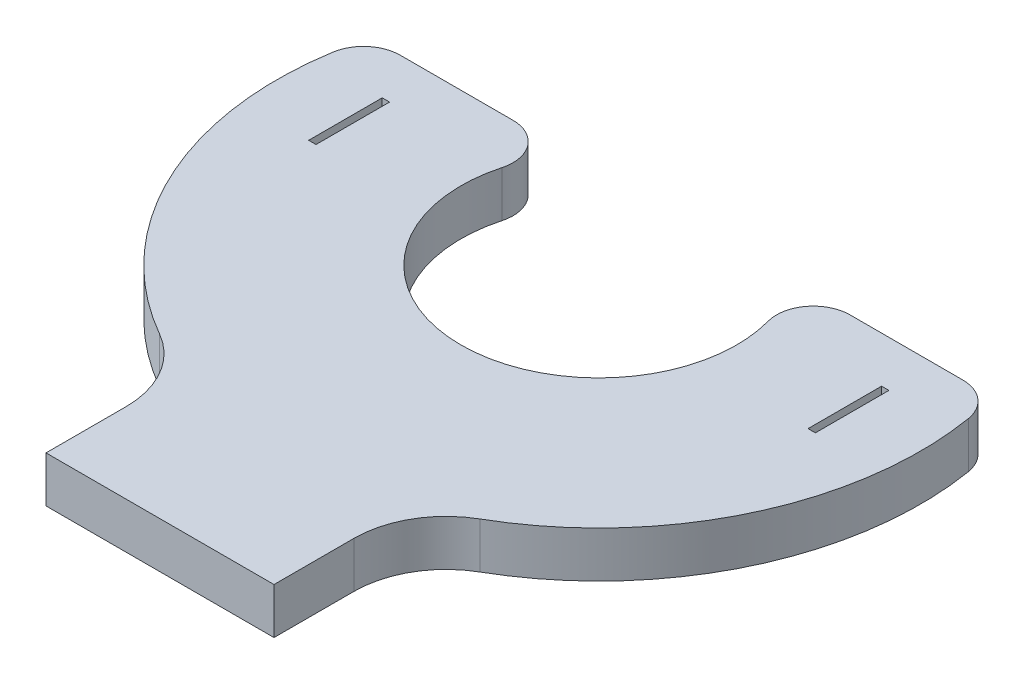
ISO-10303-21;
HEADER;
FILE_DESCRIPTION(('STEP AP214'),'2;1');
FILE_NAME('part.step','',(''),(''),'','','');
FILE_SCHEMA(('AUTOMOTIVE_DESIGN { 1 0 10303 214 1 1 1 1 }'));
ENDSEC;
DATA;
#1=APPLICATION_CONTEXT('core data for automotive mechanical design processes');
#2=APPLICATION_PROTOCOL_DEFINITION('international standard','automotive_design',2000,#1);
#3=PRODUCT_CONTEXT('',#1,'mechanical');
#4=PRODUCT('Part','Part','',(#3));
#5=PRODUCT_RELATED_PRODUCT_CATEGORY('part','',(#4));
#6=PRODUCT_DEFINITION_FORMATION('','',#4);
#7=PRODUCT_DEFINITION_CONTEXT('part definition',#1,'design');
#8=PRODUCT_DEFINITION('design','',#6,#7);
#9=PRODUCT_DEFINITION_SHAPE('','',#8);
#10=(LENGTH_UNIT() NAMED_UNIT(*) SI_UNIT(.MILLI.,.METRE.));
#11=(NAMED_UNIT(*) PLANE_ANGLE_UNIT() SI_UNIT($,.RADIAN.));
#12=(NAMED_UNIT(*) SI_UNIT($,.STERADIAN.) SOLID_ANGLE_UNIT());
#13=UNCERTAINTY_MEASURE_WITH_UNIT(LENGTH_MEASURE(1.E-05),#10,'distance_accuracy_value','');
#14=(GEOMETRIC_REPRESENTATION_CONTEXT(3) GLOBAL_UNCERTAINTY_ASSIGNED_CONTEXT((#13)) GLOBAL_UNIT_ASSIGNED_CONTEXT((#10,
#11,#12)) REPRESENTATION_CONTEXT('',''));
#15=CARTESIAN_POINT('',(0.,0.,0.));
#16=DIRECTION('',(0.,0.,1.));
#17=DIRECTION('',(1.,0.,0.));
#18=AXIS2_PLACEMENT_3D('',#15,#16,#17);
#19=CARTESIAN_POINT('',(0.,3.175,0.));
#20=DIRECTION('',(0.,1.,0.));
#21=DIRECTION('',(0.,0.,1.));
#22=AXIS2_PLACEMENT_3D('',#19,#20,#21);
#23=PLANE('',#22);
#24=DIRECTION('',(-1.,0.,0.));
#25=VECTOR('',#24,1.);
#26=CARTESIAN_POINT('',(-21.4776488471155,3.175,-5.71499999999996));
#27=LINE('',#26,#25);
#28=CARTESIAN_POINT('',(-11.6397422651878,3.175,-5.71499999999996));
#29=VERTEX_POINT('',#28);
#30=CARTESIAN_POINT('',(-19.4272643467885,3.175,-5.71499999999996));
#31=VERTEX_POINT('',#30);
#32=EDGE_CURVE('E273',#29,#31,#27,.T.);
#33=ORIENTED_EDGE('',*,*,#32,.T.);
#34=CARTESIAN_POINT('',(-19.4272643467885,3.175,-3.17499999999996));
#35=DIRECTION('',(0.,1.,0.));
#36=DIRECTION('',(0.,0.,1.));
#37=AXIS2_PLACEMENT_3D('',#34,#35,#36);
#38=CIRCLE('',#37,2.54);
#39=CARTESIAN_POINT('',(-21.9340081334709,3.175,-3.5846774193548));
#40=VERTEX_POINT('',#39);
#41=EDGE_CURVE('E323',#31,#40,#38,.T.);
#42=ORIENTED_EDGE('',*,*,#41,.T.);
#43=CARTESIAN_POINT('',(0.,3.175,0.));
#44=DIRECTION('',(0.,1.,0.));
#45=DIRECTION('',(0.,0.,1.));
#46=AXIS2_PLACEMENT_3D('',#43,#44,#45);
#47=CIRCLE('',#46,22.225);
#48=CARTESIAN_POINT('',(-11.0631111111111,3.175,19.2758449242364));
#49=VERTEX_POINT('',#48);
#50=EDGE_CURVE('E255',#40,#49,#47,.T.);
#51=ORIENTED_EDGE('',*,*,#50,.T.);
#52=CARTESIAN_POINT('',(-14.224,3.175,24.7832291883039));
#53=DIRECTION('',(0.,1.,0.));
#54=DIRECTION('',(0.,0.,1.));
#55=AXIS2_PLACEMENT_3D('',#52,#53,#54);
#56=CIRCLE('',#55,6.35);
#57=CARTESIAN_POINT('',(-7.874,3.175,24.7832291883039));
#58=VERTEX_POINT('',#57);
#59=EDGE_CURVE('E11',#49,#58,#56,.F.);
#60=ORIENTED_EDGE('',*,*,#59,.T.);
#61=DIRECTION('',(0.,0.,1.));
#62=VECTOR('',#61,1.);
#63=CARTESIAN_POINT('',(-7.874,3.175,20.7834248621347));
#64=LINE('',#63,#62);
#65=CARTESIAN_POINT('',(-7.874,3.175,30.3084248621347));
#66=VERTEX_POINT('',#65);
#67=EDGE_CURVE('E257',#58,#66,#64,.T.);
#68=ORIENTED_EDGE('',*,*,#67,.T.);
#69=DIRECTION('',(1.,0.,0.));
#70=VECTOR('',#69,1.);
#71=CARTESIAN_POINT('',(-7.874,3.175,30.3084248621347));
#72=LINE('',#71,#70);
#73=CARTESIAN_POINT('',(7.874,3.175,30.3084248621347));
#74=VERTEX_POINT('',#73);
#75=EDGE_CURVE('E260',#66,#74,#72,.T.);
#76=ORIENTED_EDGE('',*,*,#75,.T.);
#77=DIRECTION('',(0.,0.,-1.));
#78=VECTOR('',#77,1.);
#79=CARTESIAN_POINT('',(7.874,3.175,20.7834248621347));
#80=LINE('',#79,#78);
#81=CARTESIAN_POINT('',(7.874,3.175,24.7832291883039));
#82=VERTEX_POINT('',#81);
#83=EDGE_CURVE('E262',#74,#82,#80,.T.);
#84=ORIENTED_EDGE('',*,*,#83,.T.);
#85=CARTESIAN_POINT('',(14.224,3.175,24.7832291883039));
#86=DIRECTION('',(0.,1.,0.));
#87=DIRECTION('',(0.,0.,1.));
#88=AXIS2_PLACEMENT_3D('',#85,#86,#87);
#89=CIRCLE('',#88,6.35);
#90=CARTESIAN_POINT('',(11.0631111111111,3.175,19.2758449242364));
#91=VERTEX_POINT('',#90);
#92=EDGE_CURVE('E349',#82,#91,#89,.F.);
#93=ORIENTED_EDGE('',*,*,#92,.T.);
#94=CARTESIAN_POINT('',(0.,3.175,0.));
#95=DIRECTION('',(0.,1.,0.));
#96=DIRECTION('',(0.,0.,1.));
#97=AXIS2_PLACEMENT_3D('',#94,#95,#96);
#98=CIRCLE('',#97,22.225);
#99=CARTESIAN_POINT('',(21.9340081334709,3.175,-3.5846774193548));
#100=VERTEX_POINT('',#99);
#101=EDGE_CURVE('E265',#91,#100,#98,.T.);
#102=ORIENTED_EDGE('',*,*,#101,.T.);
#103=CARTESIAN_POINT('',(19.4272643467885,3.175,-3.17499999999996));
#104=DIRECTION('',(0.,1.,0.));
#105=DIRECTION('',(0.,0.,1.));
#106=AXIS2_PLACEMENT_3D('',#103,#104,#105);
#107=CIRCLE('',#106,2.54);
#108=CARTESIAN_POINT('',(19.4272643467885,3.175,-5.71499999999996));
#109=VERTEX_POINT('',#108);
#110=EDGE_CURVE('E317',#100,#109,#107,.T.);
#111=ORIENTED_EDGE('',*,*,#110,.T.);
#112=DIRECTION('',(-1.,0.,0.));
#113=VECTOR('',#112,1.);
#114=CARTESIAN_POINT('',(21.4776488471155,3.175,-5.71499999999996));
#115=LINE('',#114,#113);
#116=CARTESIAN_POINT('',(11.6397422651878,3.175,-5.71499999999996));
#117=VERTEX_POINT('',#116);
#118=EDGE_CURVE('E267',#109,#117,#115,.T.);
#119=ORIENTED_EDGE('',*,*,#118,.T.);
#120=CARTESIAN_POINT('',(11.6397422651878,3.175,-3.17499999999996));
#121=DIRECTION('',(0.,1.,0.));
#122=DIRECTION('',(0.,0.,1.));
#123=AXIS2_PLACEMENT_3D('',#120,#121,#122);
#124=CIRCLE('',#123,2.54);
#125=CARTESIAN_POINT('',(9.18927020935882,3.175,-2.50657894736839));
#126=VERTEX_POINT('',#125);
#127=EDGE_CURVE('E319',#117,#126,#124,.T.);
#128=ORIENTED_EDGE('',*,*,#127,.T.);
#129=CARTESIAN_POINT('',(0.,3.175,0.));
#130=DIRECTION('',(0.,-1.,0.));
#131=DIRECTION('',(0.,0.,1.));
#132=AXIS2_PLACEMENT_3D('',#129,#130,#131);
#133=CIRCLE('',#132,9.525);
#134=CARTESIAN_POINT('',(-9.18927020935882,3.175,-2.50657894736839));
#135=VERTEX_POINT('',#134);
#136=EDGE_CURVE('E270',#126,#135,#133,.T.);
#137=ORIENTED_EDGE('',*,*,#136,.T.);
#138=CARTESIAN_POINT('',(-11.6397422651878,3.175,-3.17499999999996));
#139=DIRECTION('',(0.,1.,0.));
#140=DIRECTION('',(0.,0.,1.));
#141=AXIS2_PLACEMENT_3D('',#138,#139,#140);
#142=CIRCLE('',#141,2.54);
#143=EDGE_CURVE('E321',#135,#29,#142,.T.);
#144=ORIENTED_EDGE('',*,*,#143,.T.);
#145=EDGE_LOOP('',(#33,#42,#51,#60,#68,#76,#84,#93,#102,#111,#119,#128,#137,#144));
#146=FACE_BOUND('',#145,.T.);
#147=DIRECTION('',(-1.,0.,0.));
#148=VECTOR('',#147,1.);
#149=CARTESIAN_POINT('',(-17.5006,3.175,-2.53999999999996));
#150=LINE('',#149,#148);
#151=CARTESIAN_POINT('',(-16.9926,3.175,-2.53999999999995));
#152=VERTEX_POINT('',#151);
#153=CARTESIAN_POINT('',(-17.5006,3.175,-2.53999999999996));
#154=VERTEX_POINT('',#153);
#155=EDGE_CURVE('E226',#152,#154,#150,.T.);
#156=ORIENTED_EDGE('',*,*,#155,.F.);
#157=DIRECTION('',(0.,0.,-1.));
#158=VECTOR('',#157,1.);
#159=CARTESIAN_POINT('',(-16.9926,3.175,-2.53999999999995));
#160=LINE('',#159,#158);
#161=CARTESIAN_POINT('',(-16.9926,3.175,2.54000000000003));
#162=VERTEX_POINT('',#161);
#163=EDGE_CURVE('E224',#162,#152,#160,.T.);
#164=ORIENTED_EDGE('',*,*,#163,.F.);
#165=DIRECTION('',(1.,0.,0.));
#166=VECTOR('',#165,1.);
#167=CARTESIAN_POINT('',(-17.5006,3.175,2.54000000000003));
#168=LINE('',#167,#166);
#169=CARTESIAN_POINT('',(-17.5006,3.175,2.54000000000003));
#170=VERTEX_POINT('',#169);
#171=EDGE_CURVE('E232',#170,#162,#168,.T.);
#172=ORIENTED_EDGE('',*,*,#171,.F.);
#173=DIRECTION('',(0.,0.,1.));
#174=VECTOR('',#173,1.);
#175=CARTESIAN_POINT('',(-17.5006,3.175,-2.53999999999996));
#176=LINE('',#175,#174);
#177=EDGE_CURVE('E229',#154,#170,#176,.T.);
#178=ORIENTED_EDGE('',*,*,#177,.F.);
#179=EDGE_LOOP('',(#156,#164,#172,#178));
#180=FACE_BOUND('',#179,.T.);
#181=DIRECTION('',(-1.,0.,0.));
#182=VECTOR('',#181,1.);
#183=CARTESIAN_POINT('',(16.9926,3.175,-2.53999999999995));
#184=LINE('',#183,#182);
#185=CARTESIAN_POINT('',(17.5006,3.175,-2.53999999999995));
#186=VERTEX_POINT('',#185);
#187=CARTESIAN_POINT('',(16.9926,3.175,-2.53999999999995));
#188=VERTEX_POINT('',#187);
#189=EDGE_CURVE('E193',#186,#188,#184,.T.);
#190=ORIENTED_EDGE('',*,*,#189,.F.);
#191=DIRECTION('',(0.,0.,-1.));
#192=VECTOR('',#191,1.);
#193=CARTESIAN_POINT('',(17.5006,3.175,-2.53999999999995));
#194=LINE('',#193,#192);
#195=CARTESIAN_POINT('',(17.5006,3.175,2.54000000000003));
#196=VERTEX_POINT('',#195);
#197=EDGE_CURVE('E183',#196,#186,#194,.T.);
#198=ORIENTED_EDGE('',*,*,#197,.F.);
#199=DIRECTION('',(1.,0.,0.));
#200=VECTOR('',#199,1.);
#201=CARTESIAN_POINT('',(16.9926,3.175,2.54000000000004));
#202=LINE('',#201,#200);
#203=CARTESIAN_POINT('',(16.9926,3.175,2.54000000000004));
#204=VERTEX_POINT('',#203);
#205=EDGE_CURVE('E208',#204,#196,#202,.T.);
#206=ORIENTED_EDGE('',*,*,#205,.F.);
#207=DIRECTION('',(0.,0.,1.));
#208=VECTOR('',#207,1.);
#209=CARTESIAN_POINT('',(16.9926,3.175,-2.53999999999995));
#210=LINE('',#209,#208);
#211=EDGE_CURVE('E206',#188,#204,#210,.T.);
#212=ORIENTED_EDGE('',*,*,#211,.F.);
#213=EDGE_LOOP('',(#190,#198,#206,#212));
#214=FACE_BOUND('',#213,.T.);
#215=ADVANCED_FACE('F33',(#146,#180,#214),#23,.T.);
#216=CARTESIAN_POINT('',(0.,0.,0.));
#217=DIRECTION('',(0.,1.,0.));
#218=DIRECTION('',(0.,0.,1.));
#219=AXIS2_PLACEMENT_3D('',#216,#217,#218);
#220=PLANE('',#219);
#221=DIRECTION('',(0.,0.,-1.));
#222=VECTOR('',#221,1.);
#223=CARTESIAN_POINT('',(-16.9926,0.,-2.53999999999995));
#224=LINE('',#223,#222);
#225=CARTESIAN_POINT('',(-16.9926,0.,2.54000000000003));
#226=VERTEX_POINT('',#225);
#227=CARTESIAN_POINT('',(-16.9926,0.,-2.53999999999995));
#228=VERTEX_POINT('',#227);
#229=EDGE_CURVE('E201',#226,#228,#224,.T.);
#230=ORIENTED_EDGE('',*,*,#229,.T.);
#231=DIRECTION('',(-1.,0.,0.));
#232=VECTOR('',#231,1.);
#233=CARTESIAN_POINT('',(-17.5006,0.,-2.53999999999996));
#234=LINE('',#233,#232);
#235=CARTESIAN_POINT('',(-17.5006,0.,-2.53999999999996));
#236=VERTEX_POINT('',#235);
#237=EDGE_CURVE('E237',#228,#236,#234,.T.);
#238=ORIENTED_EDGE('',*,*,#237,.T.);
#239=DIRECTION('',(0.,0.,1.));
#240=VECTOR('',#239,1.);
#241=CARTESIAN_POINT('',(-17.5006,0.,-2.53999999999996));
#242=LINE('',#241,#240);
#243=CARTESIAN_POINT('',(-17.5006,0.,2.54000000000003));
#244=VERTEX_POINT('',#243);
#245=EDGE_CURVE('E240',#236,#244,#242,.T.);
#246=ORIENTED_EDGE('',*,*,#245,.T.);
#247=DIRECTION('',(1.,0.,0.));
#248=VECTOR('',#247,1.);
#249=CARTESIAN_POINT('',(-17.5006,0.,2.54000000000003));
#250=LINE('',#249,#248);
#251=EDGE_CURVE('E227',#244,#226,#250,.T.);
#252=ORIENTED_EDGE('',*,*,#251,.T.);
#253=EDGE_LOOP('',(#230,#238,#246,#252));
#254=FACE_BOUND('',#253,.T.);
#255=CARTESIAN_POINT('',(0.,0.,0.));
#256=DIRECTION('',(0.,1.,0.));
#257=DIRECTION('',(0.,0.,1.));
#258=AXIS2_PLACEMENT_3D('',#255,#256,#257);
#259=CIRCLE('',#258,22.225);
#260=CARTESIAN_POINT('',(-21.9340081334709,0.,-3.5846774193548));
#261=VERTEX_POINT('',#260);
#262=CARTESIAN_POINT('',(-11.0631111111111,0.,19.2758449242364));
#263=VERTEX_POINT('',#262);
#264=EDGE_CURVE('E254',#261,#263,#259,.T.);
#265=ORIENTED_EDGE('',*,*,#264,.F.);
#266=CARTESIAN_POINT('',(-19.4272643467885,0.,-3.17499999999996));
#267=DIRECTION('',(0.,1.,0.));
#268=DIRECTION('',(0.,0.,1.));
#269=AXIS2_PLACEMENT_3D('',#266,#267,#268);
#270=CIRCLE('',#269,2.54);
#271=CARTESIAN_POINT('',(-19.4272643467885,0.,-5.71499999999996));
#272=VERTEX_POINT('',#271);
#273=EDGE_CURVE('E310',#261,#272,#270,.F.);
#274=ORIENTED_EDGE('',*,*,#273,.T.);
#275=DIRECTION('',(-1.,0.,0.));
#276=VECTOR('',#275,1.);
#277=CARTESIAN_POINT('',(-21.4776488471155,0.,-5.71499999999996));
#278=LINE('',#277,#276);
#279=CARTESIAN_POINT('',(-11.6397422651878,0.,-5.71499999999996));
#280=VERTEX_POINT('',#279);
#281=EDGE_CURVE('E258',#280,#272,#278,.T.);
#282=ORIENTED_EDGE('',*,*,#281,.F.);
#283=CARTESIAN_POINT('',(-11.6397422651878,0.,-3.17499999999996));
#284=DIRECTION('',(0.,1.,0.));
#285=DIRECTION('',(0.,0.,1.));
#286=AXIS2_PLACEMENT_3D('',#283,#284,#285);
#287=CIRCLE('',#286,2.54);
#288=CARTESIAN_POINT('',(-9.18927020935882,0.,-2.50657894736839));
#289=VERTEX_POINT('',#288);
#290=EDGE_CURVE('E308',#280,#289,#287,.F.);
#291=ORIENTED_EDGE('',*,*,#290,.T.);
#292=CARTESIAN_POINT('',(0.,0.,0.));
#293=DIRECTION('',(0.,-1.,0.));
#294=DIRECTION('',(0.,0.,1.));
#295=AXIS2_PLACEMENT_3D('',#292,#293,#294);
#296=CIRCLE('',#295,9.525);
#297=CARTESIAN_POINT('',(9.18927020935882,0.,-2.50657894736839));
#298=VERTEX_POINT('',#297);
#299=EDGE_CURVE('E290',#298,#289,#296,.T.);
#300=ORIENTED_EDGE('',*,*,#299,.F.);
#301=CARTESIAN_POINT('',(11.6397422651878,0.,-3.17499999999996));
#302=DIRECTION('',(0.,1.,0.));
#303=DIRECTION('',(0.,0.,1.));
#304=AXIS2_PLACEMENT_3D('',#301,#302,#303);
#305=CIRCLE('',#304,2.54);
#306=CARTESIAN_POINT('',(11.6397422651878,0.,-5.71499999999996));
#307=VERTEX_POINT('',#306);
#308=EDGE_CURVE('E306',#298,#307,#305,.F.);
#309=ORIENTED_EDGE('',*,*,#308,.T.);
#310=DIRECTION('',(-1.,0.,0.));
#311=VECTOR('',#310,1.);
#312=CARTESIAN_POINT('',(21.4776488471155,0.,-5.71499999999996));
#313=LINE('',#312,#311);
#314=CARTESIAN_POINT('',(19.4272643467885,0.,-5.71499999999996));
#315=VERTEX_POINT('',#314);
#316=EDGE_CURVE('E287',#315,#307,#313,.T.);
#317=ORIENTED_EDGE('',*,*,#316,.F.);
#318=CARTESIAN_POINT('',(19.4272643467885,0.,-3.17499999999996));
#319=DIRECTION('',(0.,1.,0.));
#320=DIRECTION('',(0.,0.,1.));
#321=AXIS2_PLACEMENT_3D('',#318,#319,#320);
#322=CIRCLE('',#321,2.54);
#323=CARTESIAN_POINT('',(21.9340081334709,0.,-3.5846774193548));
#324=VERTEX_POINT('',#323);
#325=EDGE_CURVE('E303',#315,#324,#322,.F.);
#326=ORIENTED_EDGE('',*,*,#325,.T.);
#327=CARTESIAN_POINT('',(0.,0.,0.));
#328=DIRECTION('',(0.,1.,0.));
#329=DIRECTION('',(0.,0.,1.));
#330=AXIS2_PLACEMENT_3D('',#327,#328,#329);
#331=CIRCLE('',#330,22.225);
#332=CARTESIAN_POINT('',(11.0631111111111,0.,19.2758449242364));
#333=VERTEX_POINT('',#332);
#334=EDGE_CURVE('E285',#333,#324,#331,.T.);
#335=ORIENTED_EDGE('',*,*,#334,.F.);
#336=CARTESIAN_POINT('',(14.224,0.,24.7832291883039));
#337=DIRECTION('',(0.,1.,0.));
#338=DIRECTION('',(0.,0.,1.));
#339=AXIS2_PLACEMENT_3D('',#336,#337,#338);
#340=CIRCLE('',#339,6.35);
#341=CARTESIAN_POINT('',(7.874,0.,24.7832291883039));
#342=VERTEX_POINT('',#341);
#343=EDGE_CURVE('E347',#333,#342,#340,.T.);
#344=ORIENTED_EDGE('',*,*,#343,.T.);
#345=DIRECTION('',(0.,0.,-1.));
#346=VECTOR('',#345,1.);
#347=CARTESIAN_POINT('',(7.874,0.,20.7834248621347));
#348=LINE('',#347,#346);
#349=CARTESIAN_POINT('',(7.874,0.,30.3084248621347));
#350=VERTEX_POINT('',#349);
#351=EDGE_CURVE('E282',#350,#342,#348,.T.);
#352=ORIENTED_EDGE('',*,*,#351,.F.);
#353=DIRECTION('',(1.,0.,0.));
#354=VECTOR('',#353,1.);
#355=CARTESIAN_POINT('',(-7.874,0.,30.3084248621347));
#356=LINE('',#355,#354);
#357=CARTESIAN_POINT('',(-7.874,0.,30.3084248621347));
#358=VERTEX_POINT('',#357);
#359=EDGE_CURVE('E280',#358,#350,#356,.T.);
#360=ORIENTED_EDGE('',*,*,#359,.F.);
#361=DIRECTION('',(0.,0.,1.));
#362=VECTOR('',#361,1.);
#363=CARTESIAN_POINT('',(-7.874,0.,20.7834248621347));
#364=LINE('',#363,#362);
#365=CARTESIAN_POINT('',(-7.874,0.,24.7832291883039));
#366=VERTEX_POINT('',#365);
#367=EDGE_CURVE('E278',#366,#358,#364,.T.);
#368=ORIENTED_EDGE('',*,*,#367,.F.);
#369=CARTESIAN_POINT('',(-14.224,0.,24.7832291883039));
#370=DIRECTION('',(0.,1.,0.));
#371=DIRECTION('',(0.,0.,1.));
#372=AXIS2_PLACEMENT_3D('',#369,#370,#371);
#373=CIRCLE('',#372,6.35);
#374=EDGE_CURVE('E41',#366,#263,#373,.T.);
#375=ORIENTED_EDGE('',*,*,#374,.T.);
#376=EDGE_LOOP('',(#265,#274,#282,#291,#300,#309,#317,#326,#335,#344,#352,#360,#368,#375));
#377=FACE_BOUND('',#376,.T.);
#378=DIRECTION('',(0.,0.,-1.));
#379=VECTOR('',#378,1.);
#380=CARTESIAN_POINT('',(17.5006,0.,-2.53999999999995));
#381=LINE('',#380,#379);
#382=CARTESIAN_POINT('',(17.5006,0.,2.54000000000003));
#383=VERTEX_POINT('',#382);
#384=CARTESIAN_POINT('',(17.5006,0.,-2.53999999999995));
#385=VERTEX_POINT('',#384);
#386=EDGE_CURVE('E212',#383,#385,#381,.T.);
#387=ORIENTED_EDGE('',*,*,#386,.T.);
#388=DIRECTION('',(-1.,0.,0.));
#389=VECTOR('',#388,1.);
#390=CARTESIAN_POINT('',(16.9926,0.,-2.53999999999995));
#391=LINE('',#390,#389);
#392=CARTESIAN_POINT('',(16.9926,0.,-2.53999999999995));
#393=VERTEX_POINT('',#392);
#394=EDGE_CURVE('E200',#385,#393,#391,.T.);
#395=ORIENTED_EDGE('',*,*,#394,.T.);
#396=DIRECTION('',(0.,0.,1.));
#397=VECTOR('',#396,1.);
#398=CARTESIAN_POINT('',(16.9926,0.,-2.53999999999995));
#399=LINE('',#398,#397);
#400=CARTESIAN_POINT('',(16.9926,0.,2.54000000000004));
#401=VERTEX_POINT('',#400);
#402=EDGE_CURVE('E215',#393,#401,#399,.T.);
#403=ORIENTED_EDGE('',*,*,#402,.T.);
#404=DIRECTION('',(1.,0.,0.));
#405=VECTOR('',#404,1.);
#406=CARTESIAN_POINT('',(16.9926,0.,2.54000000000004));
#407=LINE('',#406,#405);
#408=EDGE_CURVE('E194',#401,#383,#407,.T.);
#409=ORIENTED_EDGE('',*,*,#408,.T.);
#410=EDGE_LOOP('',(#387,#395,#403,#409));
#411=FACE_BOUND('',#410,.T.);
#412=ADVANCED_FACE('F365',(#254,#377,#411),#220,.F.);
#413=CARTESIAN_POINT('',(0.,3.175,0.));
#414=DIRECTION('',(0.,-1.,0.));
#415=DIRECTION('',(0.,0.,-1.));
#416=AXIS2_PLACEMENT_3D('',#413,#414,#415);
#417=CYLINDRICAL_SURFACE('',#416,22.225);
#418=ORIENTED_EDGE('',*,*,#264,.T.);
#419=DIRECTION('',(0.,-1.,0.));
#420=VECTOR('',#419,1.);
#421=CARTESIAN_POINT('',(-11.0631111111111,3.175,19.2758449242364));
#422=LINE('',#421,#420);
#423=EDGE_CURVE('E54',#263,#49,#422,.F.);
#424=ORIENTED_EDGE('',*,*,#423,.T.);
#425=ORIENTED_EDGE('',*,*,#50,.F.);
#426=DIRECTION('',(0.,-1.,0.));
#427=VECTOR('',#426,1.);
#428=CARTESIAN_POINT('',(-21.9340081334709,3.175,-3.5846774193548));
#429=LINE('',#428,#427);
#430=EDGE_CURVE('E300',#40,#261,#429,.T.);
#431=ORIENTED_EDGE('',*,*,#430,.T.);
#432=EDGE_LOOP('',(#418,#424,#425,#431));
#433=FACE_BOUND('',#432,.T.);
#434=ADVANCED_FACE('F383',(#433),#417,.T.);
#435=CARTESIAN_POINT('',(-7.874,3.175,20.7834248621347));
#436=DIRECTION('',(1.,0.,0.));
#437=DIRECTION('',(0.,0.,-1.));
#438=AXIS2_PLACEMENT_3D('',#435,#436,#437);
#439=PLANE('',#438);
#440=ORIENTED_EDGE('',*,*,#67,.F.);
#441=DIRECTION('',(0.,1.,0.));
#442=VECTOR('',#441,1.);
#443=CARTESIAN_POINT('',(-7.874,0.,24.7832291883039));
#444=LINE('',#443,#442);
#445=EDGE_CURVE('E343',#58,#366,#444,.F.);
#446=ORIENTED_EDGE('',*,*,#445,.T.);
#447=ORIENTED_EDGE('',*,*,#367,.T.);
#448=DIRECTION('',(0.,-1.,0.));
#449=VECTOR('',#448,1.);
#450=CARTESIAN_POINT('',(-7.874,3.175,30.3084248621347));
#451=LINE('',#450,#449);
#452=EDGE_CURVE('E297',#66,#358,#451,.T.);
#453=ORIENTED_EDGE('',*,*,#452,.F.);
#454=EDGE_LOOP('',(#440,#446,#447,#453));
#455=FACE_BOUND('',#454,.T.);
#456=ADVANCED_FACE('F377',(#455),#439,.F.);
#457=CARTESIAN_POINT('',(-7.874,3.175,30.3084248621347));
#458=DIRECTION('',(0.,0.,-1.));
#459=DIRECTION('',(-1.,0.,0.));
#460=AXIS2_PLACEMENT_3D('',#457,#458,#459);
#461=PLANE('',#460);
#462=ORIENTED_EDGE('',*,*,#359,.T.);
#463=DIRECTION('',(0.,-1.,0.));
#464=VECTOR('',#463,1.);
#465=CARTESIAN_POINT('',(7.874,3.175,30.3084248621347));
#466=LINE('',#465,#464);
#467=EDGE_CURVE('E276',#74,#350,#466,.T.);
#468=ORIENTED_EDGE('',*,*,#467,.F.);
#469=ORIENTED_EDGE('',*,*,#75,.F.);
#470=ORIENTED_EDGE('',*,*,#452,.T.);
#471=EDGE_LOOP('',(#462,#468,#469,#470));
#472=FACE_BOUND('',#471,.T.);
#473=ADVANCED_FACE('F373',(#472),#461,.F.);
#474=CARTESIAN_POINT('',(7.874,3.175,20.7834248621347));
#475=DIRECTION('',(-1.,0.,0.));
#476=DIRECTION('',(0.,0.,1.));
#477=AXIS2_PLACEMENT_3D('',#474,#475,#476);
#478=PLANE('',#477);
#479=ORIENTED_EDGE('',*,*,#351,.T.);
#480=DIRECTION('',(0.,1.,0.));
#481=VECTOR('',#480,1.);
#482=CARTESIAN_POINT('',(7.874,3.175,24.7832291883039));
#483=LINE('',#482,#481);
#484=EDGE_CURVE('E341',#342,#82,#483,.T.);
#485=ORIENTED_EDGE('',*,*,#484,.T.);
#486=ORIENTED_EDGE('',*,*,#83,.F.);
#487=ORIENTED_EDGE('',*,*,#467,.T.);
#488=EDGE_LOOP('',(#479,#485,#486,#487));
#489=FACE_BOUND('',#488,.T.);
#490=ADVANCED_FACE('F369',(#489),#478,.F.);
#491=CARTESIAN_POINT('',(0.,3.175,0.));
#492=DIRECTION('',(0.,-1.,0.));
#493=DIRECTION('',(0.,0.,-1.));
#494=AXIS2_PLACEMENT_3D('',#491,#492,#493);
#495=CYLINDRICAL_SURFACE('',#494,22.225);
#496=ORIENTED_EDGE('',*,*,#101,.F.);
#497=DIRECTION('',(0.,-1.,0.));
#498=VECTOR('',#497,1.);
#499=CARTESIAN_POINT('',(11.0631111111111,3.175,19.2758449242364));
#500=LINE('',#499,#498);
#501=EDGE_CURVE('E338',#91,#333,#500,.T.);
#502=ORIENTED_EDGE('',*,*,#501,.T.);
#503=ORIENTED_EDGE('',*,*,#334,.T.);
#504=DIRECTION('',(0.,-1.,0.));
#505=VECTOR('',#504,1.);
#506=CARTESIAN_POINT('',(21.9340081334709,3.175,-3.5846774193548));
#507=LINE('',#506,#505);
#508=EDGE_CURVE('E335',#324,#100,#507,.F.);
#509=ORIENTED_EDGE('',*,*,#508,.T.);
#510=EDGE_LOOP('',(#496,#502,#503,#509));
#511=FACE_BOUND('',#510,.T.);
#512=ADVANCED_FACE('F359',(#511),#495,.T.);
#513=CARTESIAN_POINT('',(21.4776488471155,3.175,-5.71499999999996));
#514=DIRECTION('',(0.,0.,1.));
#515=DIRECTION('',(1.,0.,0.));
#516=AXIS2_PLACEMENT_3D('',#513,#514,#515);
#517=PLANE('',#516);
#518=ORIENTED_EDGE('',*,*,#316,.T.);
#519=DIRECTION('',(0.,-1.,0.));
#520=VECTOR('',#519,1.);
#521=CARTESIAN_POINT('',(11.6397422651878,3.175,-5.71499999999996));
#522=LINE('',#521,#520);
#523=EDGE_CURVE('E333',#307,#117,#522,.F.);
#524=ORIENTED_EDGE('',*,*,#523,.T.);
#525=ORIENTED_EDGE('',*,*,#118,.F.);
#526=DIRECTION('',(0.,-1.,0.));
#527=VECTOR('',#526,1.);
#528=CARTESIAN_POINT('',(19.4272643467885,3.175,-5.71499999999996));
#529=LINE('',#528,#527);
#530=EDGE_CURVE('E330',#109,#315,#529,.T.);
#531=ORIENTED_EDGE('',*,*,#530,.T.);
#532=EDGE_LOOP('',(#518,#524,#525,#531));
#533=FACE_BOUND('',#532,.T.);
#534=ADVANCED_FACE('F407',(#533),#517,.F.);
#535=CARTESIAN_POINT('',(0.,3.175,0.));
#536=DIRECTION('',(0.,-1.,0.));
#537=DIRECTION('',(0.,0.,-1.));
#538=AXIS2_PLACEMENT_3D('',#535,#536,#537);
#539=CYLINDRICAL_SURFACE('',#538,9.525);
#540=ORIENTED_EDGE('',*,*,#299,.T.);
#541=DIRECTION('',(0.,-1.,0.));
#542=VECTOR('',#541,1.);
#543=CARTESIAN_POINT('',(-9.18927020935883,3.175,-2.50657894736839));
#544=LINE('',#543,#542);
#545=EDGE_CURVE('E328',#289,#135,#544,.F.);
#546=ORIENTED_EDGE('',*,*,#545,.T.);
#547=ORIENTED_EDGE('',*,*,#136,.F.);
#548=DIRECTION('',(0.,-1.,0.));
#549=VECTOR('',#548,1.);
#550=CARTESIAN_POINT('',(9.18927020935883,3.175,-2.50657894736839));
#551=LINE('',#550,#549);
#552=EDGE_CURVE('E325',#126,#298,#551,.T.);
#553=ORIENTED_EDGE('',*,*,#552,.T.);
#554=EDGE_LOOP('',(#540,#546,#547,#553));
#555=FACE_BOUND('',#554,.T.);
#556=ADVANCED_FACE('F398',(#555),#539,.F.);
#557=CARTESIAN_POINT('',(-21.4776488471155,3.175,-5.71499999999996));
#558=DIRECTION('',(0.,0.,1.));
#559=DIRECTION('',(1.,0.,0.));
#560=AXIS2_PLACEMENT_3D('',#557,#558,#559);
#561=PLANE('',#560);
#562=ORIENTED_EDGE('',*,*,#281,.T.);
#563=DIRECTION('',(0.,-1.,0.));
#564=VECTOR('',#563,1.);
#565=CARTESIAN_POINT('',(-19.4272643467885,3.175,-5.71499999999996));
#566=LINE('',#565,#564);
#567=EDGE_CURVE('E315',#272,#31,#566,.F.);
#568=ORIENTED_EDGE('',*,*,#567,.T.);
#569=ORIENTED_EDGE('',*,*,#32,.F.);
#570=DIRECTION('',(0.,-1.,0.));
#571=VECTOR('',#570,1.);
#572=CARTESIAN_POINT('',(-11.6397422651878,3.175,-5.71499999999996));
#573=LINE('',#572,#571);
#574=EDGE_CURVE('E312',#29,#280,#573,.T.);
#575=ORIENTED_EDGE('',*,*,#574,.T.);
#576=EDGE_LOOP('',(#562,#568,#569,#575));
#577=FACE_BOUND('',#576,.T.);
#578=ADVANCED_FACE('F389',(#577),#561,.F.);
#579=CARTESIAN_POINT('',(-16.9926,3.175,-2.53999999999995));
#580=DIRECTION('',(-1.,0.,0.));
#581=DIRECTION('',(0.,0.,1.));
#582=AXIS2_PLACEMENT_3D('',#579,#580,#581);
#583=PLANE('',#582);
#584=ORIENTED_EDGE('',*,*,#229,.F.);
#585=DIRECTION('',(0.,-1.,0.));
#586=VECTOR('',#585,1.);
#587=CARTESIAN_POINT('',(-16.9926,3.175,2.54000000000003));
#588=LINE('',#587,#586);
#589=EDGE_CURVE('E234',#162,#226,#588,.T.);
#590=ORIENTED_EDGE('',*,*,#589,.F.);
#591=ORIENTED_EDGE('',*,*,#163,.T.);
#592=DIRECTION('',(0.,-1.,0.));
#593=VECTOR('',#592,1.);
#594=CARTESIAN_POINT('',(-16.9926,3.175,-2.53999999999995));
#595=LINE('',#594,#593);
#596=EDGE_CURVE('E251',#152,#228,#595,.T.);
#597=ORIENTED_EDGE('',*,*,#596,.T.);
#598=EDGE_LOOP('',(#584,#590,#591,#597));
#599=FACE_BOUND('',#598,.T.);
#600=ADVANCED_FACE('F427',(#599),#583,.T.);
#601=CARTESIAN_POINT('',(-17.5006,3.175,-2.53999999999996));
#602=DIRECTION('',(0.,0.,1.));
#603=DIRECTION('',(1.,0.,0.));
#604=AXIS2_PLACEMENT_3D('',#601,#602,#603);
#605=PLANE('',#604);
#606=ORIENTED_EDGE('',*,*,#237,.F.);
#607=ORIENTED_EDGE('',*,*,#596,.F.);
#608=ORIENTED_EDGE('',*,*,#155,.T.);
#609=DIRECTION('',(0.,-1.,0.));
#610=VECTOR('',#609,1.);
#611=CARTESIAN_POINT('',(-17.5006,3.175,-2.53999999999996));
#612=LINE('',#611,#610);
#613=EDGE_CURVE('E249',#154,#236,#612,.T.);
#614=ORIENTED_EDGE('',*,*,#613,.T.);
#615=EDGE_LOOP('',(#606,#607,#608,#614));
#616=FACE_BOUND('',#615,.T.);
#617=ADVANCED_FACE('F532',(#616),#605,.T.);
#618=CARTESIAN_POINT('',(-17.5006,3.175,-2.53999999999996));
#619=DIRECTION('',(1.,0.,0.));
#620=DIRECTION('',(0.,0.,-1.));
#621=AXIS2_PLACEMENT_3D('',#618,#619,#620);
#622=PLANE('',#621);
#623=ORIENTED_EDGE('',*,*,#245,.F.);
#624=ORIENTED_EDGE('',*,*,#613,.F.);
#625=ORIENTED_EDGE('',*,*,#177,.T.);
#626=DIRECTION('',(0.,-1.,0.));
#627=VECTOR('',#626,1.);
#628=CARTESIAN_POINT('',(-17.5006,3.175,2.54000000000003));
#629=LINE('',#628,#627);
#630=EDGE_CURVE('E247',#170,#244,#629,.T.);
#631=ORIENTED_EDGE('',*,*,#630,.T.);
#632=EDGE_LOOP('',(#623,#624,#625,#631));
#633=FACE_BOUND('',#632,.T.);
#634=ADVANCED_FACE('F540',(#633),#622,.T.);
#635=CARTESIAN_POINT('',(-17.5006,3.175,2.54000000000003));
#636=DIRECTION('',(0.,0.,-1.));
#637=DIRECTION('',(-1.,0.,0.));
#638=AXIS2_PLACEMENT_3D('',#635,#636,#637);
#639=PLANE('',#638);
#640=ORIENTED_EDGE('',*,*,#251,.F.);
#641=ORIENTED_EDGE('',*,*,#630,.F.);
#642=ORIENTED_EDGE('',*,*,#171,.T.);
#643=ORIENTED_EDGE('',*,*,#589,.T.);
#644=EDGE_LOOP('',(#640,#641,#642,#643));
#645=FACE_BOUND('',#644,.T.);
#646=ADVANCED_FACE('F547',(#645),#639,.T.);
#647=CARTESIAN_POINT('',(17.5006,3.175,-2.53999999999995));
#648=DIRECTION('',(-1.,0.,0.));
#649=DIRECTION('',(0.,0.,1.));
#650=AXIS2_PLACEMENT_3D('',#647,#648,#649);
#651=PLANE('',#650);
#652=ORIENTED_EDGE('',*,*,#386,.F.);
#653=DIRECTION('',(0.,-1.,0.));
#654=VECTOR('',#653,1.);
#655=CARTESIAN_POINT('',(17.5006,3.175,2.54000000000003));
#656=LINE('',#655,#654);
#657=EDGE_CURVE('E189',#196,#383,#656,.T.);
#658=ORIENTED_EDGE('',*,*,#657,.F.);
#659=ORIENTED_EDGE('',*,*,#197,.T.);
#660=DIRECTION('',(0.,-1.,0.));
#661=VECTOR('',#660,1.);
#662=CARTESIAN_POINT('',(17.5006,3.175,-2.53999999999995));
#663=LINE('',#662,#661);
#664=EDGE_CURVE('E186',#186,#385,#663,.T.);
#665=ORIENTED_EDGE('',*,*,#664,.T.);
#666=EDGE_LOOP('',(#652,#658,#659,#665));
#667=FACE_BOUND('',#666,.T.);
#668=ADVANCED_FACE('F185',(#667),#651,.T.);
#669=CARTESIAN_POINT('',(16.9926,3.175,-2.53999999999995));
#670=DIRECTION('',(0.,0.,1.));
#671=DIRECTION('',(1.,0.,0.));
#672=AXIS2_PLACEMENT_3D('',#669,#670,#671);
#673=PLANE('',#672);
#674=ORIENTED_EDGE('',*,*,#394,.F.);
#675=ORIENTED_EDGE('',*,*,#664,.F.);
#676=ORIENTED_EDGE('',*,*,#189,.T.);
#677=DIRECTION('',(0.,-1.,0.));
#678=VECTOR('',#677,1.);
#679=CARTESIAN_POINT('',(16.9926,3.175,-2.53999999999995));
#680=LINE('',#679,#678);
#681=EDGE_CURVE('E202',#188,#393,#680,.T.);
#682=ORIENTED_EDGE('',*,*,#681,.T.);
#683=EDGE_LOOP('',(#674,#675,#676,#682));
#684=FACE_BOUND('',#683,.T.);
#685=ADVANCED_FACE('F197',(#684),#673,.T.);
#686=CARTESIAN_POINT('',(16.9926,3.175,-2.53999999999995));
#687=DIRECTION('',(1.,0.,0.));
#688=DIRECTION('',(0.,0.,-1.));
#689=AXIS2_PLACEMENT_3D('',#686,#687,#688);
#690=PLANE('',#689);
#691=ORIENTED_EDGE('',*,*,#402,.F.);
#692=ORIENTED_EDGE('',*,*,#681,.F.);
#693=ORIENTED_EDGE('',*,*,#211,.T.);
#694=DIRECTION('',(0.,-1.,0.));
#695=VECTOR('',#694,1.);
#696=CARTESIAN_POINT('',(16.9926,3.175,2.54000000000004));
#697=LINE('',#696,#695);
#698=EDGE_CURVE('E221',#204,#401,#697,.T.);
#699=ORIENTED_EDGE('',*,*,#698,.T.);
#700=EDGE_LOOP('',(#691,#692,#693,#699));
#701=FACE_BOUND('',#700,.T.);
#702=ADVANCED_FACE('F568',(#701),#690,.T.);
#703=CARTESIAN_POINT('',(16.9926,3.175,2.54000000000004));
#704=DIRECTION('',(0.,0.,-1.));
#705=DIRECTION('',(-1.,0.,0.));
#706=AXIS2_PLACEMENT_3D('',#703,#704,#705);
#707=PLANE('',#706);
#708=ORIENTED_EDGE('',*,*,#408,.F.);
#709=ORIENTED_EDGE('',*,*,#698,.F.);
#710=ORIENTED_EDGE('',*,*,#205,.T.);
#711=ORIENTED_EDGE('',*,*,#657,.T.);
#712=EDGE_LOOP('',(#708,#709,#710,#711));
#713=FACE_BOUND('',#712,.T.);
#714=ADVANCED_FACE('F448',(#713),#707,.T.);
#715=CARTESIAN_POINT('',(-19.4272643467885,3.175,-3.17499999999996));
#716=DIRECTION('',(0.,-1.,0.));
#717=DIRECTION('',(0.,0.,-1.));
#718=AXIS2_PLACEMENT_3D('',#715,#716,#717);
#719=CYLINDRICAL_SURFACE('',#718,2.54);
#720=ORIENTED_EDGE('',*,*,#41,.F.);
#721=ORIENTED_EDGE('',*,*,#567,.F.);
#722=ORIENTED_EDGE('',*,*,#273,.F.);
#723=ORIENTED_EDGE('',*,*,#430,.F.);
#724=EDGE_LOOP('',(#720,#721,#722,#723));
#725=FACE_BOUND('',#724,.T.);
#726=ADVANCED_FACE('F385',(#725),#719,.T.);
#727=CARTESIAN_POINT('',(-11.6397422651878,3.175,-3.17499999999996));
#728=DIRECTION('',(0.,-1.,0.));
#729=DIRECTION('',(0.,0.,-1.));
#730=AXIS2_PLACEMENT_3D('',#727,#728,#729);
#731=CYLINDRICAL_SURFACE('',#730,2.54);
#732=ORIENTED_EDGE('',*,*,#143,.F.);
#733=ORIENTED_EDGE('',*,*,#545,.F.);
#734=ORIENTED_EDGE('',*,*,#290,.F.);
#735=ORIENTED_EDGE('',*,*,#574,.F.);
#736=EDGE_LOOP('',(#732,#733,#734,#735));
#737=FACE_BOUND('',#736,.T.);
#738=ADVANCED_FACE('F394',(#737),#731,.T.);
#739=CARTESIAN_POINT('',(11.6397422651878,3.175,-3.17499999999996));
#740=DIRECTION('',(0.,-1.,0.));
#741=DIRECTION('',(0.,0.,-1.));
#742=AXIS2_PLACEMENT_3D('',#739,#740,#741);
#743=CYLINDRICAL_SURFACE('',#742,2.54);
#744=ORIENTED_EDGE('',*,*,#127,.F.);
#745=ORIENTED_EDGE('',*,*,#523,.F.);
#746=ORIENTED_EDGE('',*,*,#308,.F.);
#747=ORIENTED_EDGE('',*,*,#552,.F.);
#748=EDGE_LOOP('',(#744,#745,#746,#747));
#749=FACE_BOUND('',#748,.T.);
#750=ADVANCED_FACE('F403',(#749),#743,.T.);
#751=CARTESIAN_POINT('',(19.4272643467885,3.175,-3.17499999999996));
#752=DIRECTION('',(0.,-1.,0.));
#753=DIRECTION('',(0.,0.,-1.));
#754=AXIS2_PLACEMENT_3D('',#751,#752,#753);
#755=CYLINDRICAL_SURFACE('',#754,2.54);
#756=ORIENTED_EDGE('',*,*,#110,.F.);
#757=ORIENTED_EDGE('',*,*,#508,.F.);
#758=ORIENTED_EDGE('',*,*,#325,.F.);
#759=ORIENTED_EDGE('',*,*,#530,.F.);
#760=EDGE_LOOP('',(#756,#757,#758,#759));
#761=FACE_BOUND('',#760,.T.);
#762=ADVANCED_FACE('F411',(#761),#755,.T.);
#763=CARTESIAN_POINT('',(14.224,3.175,24.7832291883039));
#764=DIRECTION('',(0.,-1.,0.));
#765=DIRECTION('',(0.,0.,-1.));
#766=AXIS2_PLACEMENT_3D('',#763,#764,#765);
#767=CYLINDRICAL_SURFACE('',#766,6.35);
#768=ORIENTED_EDGE('',*,*,#92,.F.);
#769=ORIENTED_EDGE('',*,*,#484,.F.);
#770=ORIENTED_EDGE('',*,*,#343,.F.);
#771=ORIENTED_EDGE('',*,*,#501,.F.);
#772=EDGE_LOOP('',(#768,#769,#770,#771));
#773=FACE_BOUND('',#772,.T.);
#774=ADVANCED_FACE('F363',(#773),#767,.F.);
#775=CARTESIAN_POINT('',(-14.224,3.175,24.7832291883039));
#776=DIRECTION('',(0.,-1.,0.));
#777=DIRECTION('',(0.,0.,-1.));
#778=AXIS2_PLACEMENT_3D('',#775,#776,#777);
#779=CYLINDRICAL_SURFACE('',#778,6.35);
#780=ORIENTED_EDGE('',*,*,#59,.F.);
#781=ORIENTED_EDGE('',*,*,#423,.F.);
#782=ORIENTED_EDGE('',*,*,#374,.F.);
#783=ORIENTED_EDGE('',*,*,#445,.F.);
#784=EDGE_LOOP('',(#780,#781,#782,#783));
#785=FACE_BOUND('',#784,.T.);
#786=ADVANCED_FACE('F35',(#785),#779,.F.);
#787=CLOSED_SHELL('',(#215,#412,#434,#456,#473,#490,#512,#534,#556,#578,#600,#617,#634,#646,
#668,#685,#702,#714,#726,#738,#750,#762,#774,#786));
#788=MANIFOLD_SOLID_BREP('B2',#787);
#789=ADVANCED_BREP_SHAPE_REPRESENTATION('',(#18,#788),#14);
#790=SHAPE_DEFINITION_REPRESENTATION(#9,#789);
ENDSEC;
END-ISO-10303-21;
